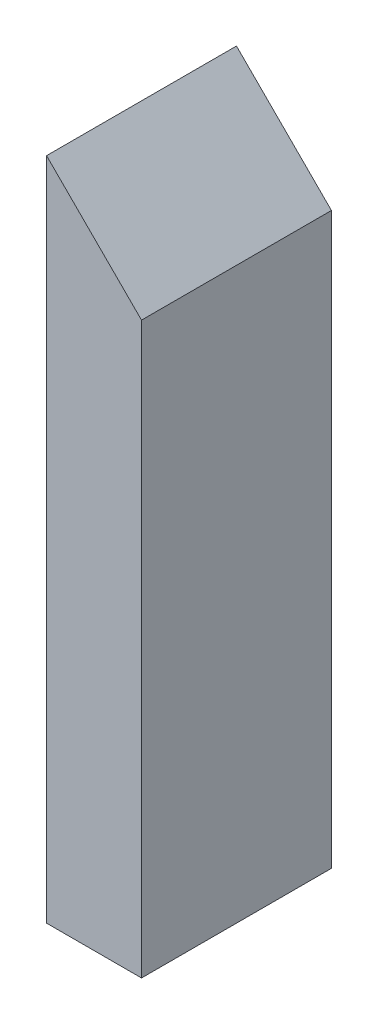
ISO-10303-21;
HEADER;
FILE_DESCRIPTION(('STEP AP214'),'2;1');
FILE_NAME('part.step','',(''),(''),'','','');
FILE_SCHEMA(('AUTOMOTIVE_DESIGN { 1 0 10303 214 1 1 1 1 }'));
ENDSEC;
DATA;
#1=APPLICATION_CONTEXT('core data for automotive mechanical design processes');
#2=APPLICATION_PROTOCOL_DEFINITION('international standard','automotive_design',2000,#1);
#3=PRODUCT_CONTEXT('',#1,'mechanical');
#4=PRODUCT('Part','Part','',(#3));
#5=PRODUCT_RELATED_PRODUCT_CATEGORY('part','',(#4));
#6=PRODUCT_DEFINITION_FORMATION('','',#4);
#7=PRODUCT_DEFINITION_CONTEXT('part definition',#1,'design');
#8=PRODUCT_DEFINITION('design','',#6,#7);
#9=PRODUCT_DEFINITION_SHAPE('','',#8);
#10=(LENGTH_UNIT() NAMED_UNIT(*) SI_UNIT(.MILLI.,.METRE.));
#11=(NAMED_UNIT(*) PLANE_ANGLE_UNIT() SI_UNIT($,.RADIAN.));
#12=(NAMED_UNIT(*) SI_UNIT($,.STERADIAN.) SOLID_ANGLE_UNIT());
#13=UNCERTAINTY_MEASURE_WITH_UNIT(LENGTH_MEASURE(1.E-05),#10,'distance_accuracy_value','');
#14=(GEOMETRIC_REPRESENTATION_CONTEXT(3) GLOBAL_UNCERTAINTY_ASSIGNED_CONTEXT((#13)) GLOBAL_UNIT_ASSIGNED_CONTEXT((#10,
#11,#12)) REPRESENTATION_CONTEXT('',''));
#15=CARTESIAN_POINT('',(0.,0.,0.));
#16=DIRECTION('',(0.,0.,1.));
#17=DIRECTION('',(1.,0.,0.));
#18=AXIS2_PLACEMENT_3D('',#15,#16,#17);
#19=CARTESIAN_POINT('',(2.5,2.5,20.));
#20=DIRECTION('',(-0.707106781186547,-0.707106781186548,0.));
#21=DIRECTION('',(0.707106781186548,-0.707106781186547,0.));
#22=AXIS2_PLACEMENT_3D('',#19,#20,#21);
#23=PLANE('',#22);
#24=DIRECTION('',(-0.707106781186548,0.707106781186547,0.));
#25=VECTOR('',#24,1.);
#26=CARTESIAN_POINT('',(2.5,2.5,0.));
#27=LINE('',#26,#25);
#28=CARTESIAN_POINT('',(5.00000000000001,0.,0.));
#29=VERTEX_POINT('',#28);
#30=CARTESIAN_POINT('',(-5.00000000000001,10.,0.));
#31=VERTEX_POINT('',#30);
#32=EDGE_CURVE('E101',#29,#31,#27,.T.);
#33=ORIENTED_EDGE('',*,*,#32,.T.);
#34=DIRECTION('',(0.,0.,-1.));
#35=VECTOR('',#34,1.);
#36=CARTESIAN_POINT('',(-5.00000000000001,10.,20.));
#37=LINE('',#36,#35);
#38=CARTESIAN_POINT('',(-5.00000000000001,10.,20.));
#39=VERTEX_POINT('',#38);
#40=EDGE_CURVE('E11',#39,#31,#37,.T.);
#41=ORIENTED_EDGE('',*,*,#40,.F.);
#42=DIRECTION('',(-0.707106781186548,0.707106781186547,0.));
#43=VECTOR('',#42,1.);
#44=CARTESIAN_POINT('',(2.5,2.5,20.));
#45=LINE('',#44,#43);
#46=CARTESIAN_POINT('',(5.00000000000001,0.,20.));
#47=VERTEX_POINT('',#46);
#48=EDGE_CURVE('E89',#47,#39,#45,.T.);
#49=ORIENTED_EDGE('',*,*,#48,.F.);
#50=DIRECTION('',(0.,0.,-1.));
#51=VECTOR('',#50,1.);
#52=CARTESIAN_POINT('',(5.00000000000001,0.,20.));
#53=LINE('',#52,#51);
#54=EDGE_CURVE('E97',#47,#29,#53,.T.);
#55=ORIENTED_EDGE('',*,*,#54,.T.);
#56=EDGE_LOOP('',(#33,#41,#49,#55));
#57=FACE_BOUND('',#56,.T.);
#58=ADVANCED_FACE('F38',(#57),#23,.F.);
#59=CARTESIAN_POINT('',(-5.00000000000001,0.,20.));
#60=DIRECTION('',(1.,0.,0.));
#61=DIRECTION('',(0.,1.,0.));
#62=AXIS2_PLACEMENT_3D('',#59,#60,#61);
#63=PLANE('',#62);
#64=DIRECTION('',(0.,-1.,0.));
#65=VECTOR('',#64,1.);
#66=CARTESIAN_POINT('',(-5.00000000000001,0.,0.));
#67=LINE('',#66,#65);
#68=CARTESIAN_POINT('',(-5.,-60.,0.));
#69=VERTEX_POINT('',#68);
#70=EDGE_CURVE('E93',#31,#69,#67,.T.);
#71=ORIENTED_EDGE('',*,*,#70,.T.);
#72=DIRECTION('',(0.,0.,-1.));
#73=VECTOR('',#72,1.);
#74=CARTESIAN_POINT('',(-5.,-60.,20.));
#75=LINE('',#74,#73);
#76=CARTESIAN_POINT('',(-5.,-60.,20.));
#77=VERTEX_POINT('',#76);
#78=EDGE_CURVE('E46',#77,#69,#75,.T.);
#79=ORIENTED_EDGE('',*,*,#78,.F.);
#80=DIRECTION('',(0.,-1.,0.));
#81=VECTOR('',#80,1.);
#82=CARTESIAN_POINT('',(-5.00000000000001,0.,20.));
#83=LINE('',#82,#81);
#84=EDGE_CURVE('E84',#39,#77,#83,.T.);
#85=ORIENTED_EDGE('',*,*,#84,.F.);
#86=ORIENTED_EDGE('',*,*,#40,.T.);
#87=EDGE_LOOP('',(#71,#79,#85,#86));
#88=FACE_BOUND('',#87,.T.);
#89=ADVANCED_FACE('F92',(#88),#63,.F.);
#90=CARTESIAN_POINT('',(0.,-60.,20.));
#91=DIRECTION('',(0.,1.,0.));
#92=DIRECTION('',(0.,0.,1.));
#93=AXIS2_PLACEMENT_3D('',#90,#91,#92);
#94=PLANE('',#93);
#95=DIRECTION('',(1.,0.,0.));
#96=VECTOR('',#95,1.);
#97=CARTESIAN_POINT('',(0.,-60.,0.));
#98=LINE('',#97,#96);
#99=CARTESIAN_POINT('',(5.,-60.,0.));
#100=VERTEX_POINT('',#99);
#101=EDGE_CURVE('E71',#69,#100,#98,.T.);
#102=ORIENTED_EDGE('',*,*,#101,.T.);
#103=DIRECTION('',(0.,0.,-1.));
#104=VECTOR('',#103,1.);
#105=CARTESIAN_POINT('',(5.,-60.,20.));
#106=LINE('',#105,#104);
#107=CARTESIAN_POINT('',(5.,-60.,20.));
#108=VERTEX_POINT('',#107);
#109=EDGE_CURVE('E94',#108,#100,#106,.T.);
#110=ORIENTED_EDGE('',*,*,#109,.F.);
#111=DIRECTION('',(1.,0.,0.));
#112=VECTOR('',#111,1.);
#113=CARTESIAN_POINT('',(0.,-60.,20.));
#114=LINE('',#113,#112);
#115=EDGE_CURVE('E87',#77,#108,#114,.T.);
#116=ORIENTED_EDGE('',*,*,#115,.F.);
#117=ORIENTED_EDGE('',*,*,#78,.T.);
#118=EDGE_LOOP('',(#102,#110,#116,#117));
#119=FACE_BOUND('',#118,.T.);
#120=ADVANCED_FACE('F95',(#119),#94,.F.);
#121=CARTESIAN_POINT('',(5.00000000000001,0.,20.));
#122=DIRECTION('',(-1.,0.,0.));
#123=DIRECTION('',(0.,-1.,0.));
#124=AXIS2_PLACEMENT_3D('',#121,#122,#123);
#125=PLANE('',#124);
#126=DIRECTION('',(0.,1.,0.));
#127=VECTOR('',#126,1.);
#128=CARTESIAN_POINT('',(5.00000000000001,0.,0.));
#129=LINE('',#128,#127);
#130=EDGE_CURVE('E77',#100,#29,#129,.T.);
#131=ORIENTED_EDGE('',*,*,#130,.T.);
#132=ORIENTED_EDGE('',*,*,#54,.F.);
#133=DIRECTION('',(0.,1.,0.));
#134=VECTOR('',#133,1.);
#135=CARTESIAN_POINT('',(5.00000000000001,0.,20.));
#136=LINE('',#135,#134);
#137=EDGE_CURVE('E54',#108,#47,#136,.T.);
#138=ORIENTED_EDGE('',*,*,#137,.F.);
#139=ORIENTED_EDGE('',*,*,#109,.T.);
#140=EDGE_LOOP('',(#131,#132,#138,#139));
#141=FACE_BOUND('',#140,.T.);
#142=ADVANCED_FACE('F108',(#141),#125,.F.);
#143=CARTESIAN_POINT('',(0.,0.,20.));
#144=DIRECTION('',(0.,0.,1.));
#145=DIRECTION('',(1.,0.,0.));
#146=AXIS2_PLACEMENT_3D('',#143,#144,#145);
#147=PLANE('',#146);
#148=ORIENTED_EDGE('',*,*,#48,.T.);
#149=ORIENTED_EDGE('',*,*,#84,.T.);
#150=ORIENTED_EDGE('',*,*,#115,.T.);
#151=ORIENTED_EDGE('',*,*,#137,.T.);
#152=EDGE_LOOP('',(#148,#149,#150,#151));
#153=FACE_BOUND('',#152,.T.);
#154=ADVANCED_FACE('F85',(#153),#147,.T.);
#155=CARTESIAN_POINT('',(0.,0.,0.));
#156=DIRECTION('',(0.,0.,1.));
#157=DIRECTION('',(1.,0.,0.));
#158=AXIS2_PLACEMENT_3D('',#155,#156,#157);
#159=PLANE('',#158);
#160=ORIENTED_EDGE('',*,*,#32,.F.);
#161=ORIENTED_EDGE('',*,*,#130,.F.);
#162=ORIENTED_EDGE('',*,*,#101,.F.);
#163=ORIENTED_EDGE('',*,*,#70,.F.);
#164=EDGE_LOOP('',(#160,#161,#162,#163));
#165=FACE_BOUND('',#164,.T.);
#166=ADVANCED_FACE('F111',(#165),#159,.F.);
#167=CLOSED_SHELL('',(#58,#89,#120,#142,#154,#166));
#168=MANIFOLD_SOLID_BREP('B2',#167);
#169=ADVANCED_BREP_SHAPE_REPRESENTATION('',(#18,#168),#14);
#170=SHAPE_DEFINITION_REPRESENTATION(#9,#169);
ENDSEC;
END-ISO-10303-21;
